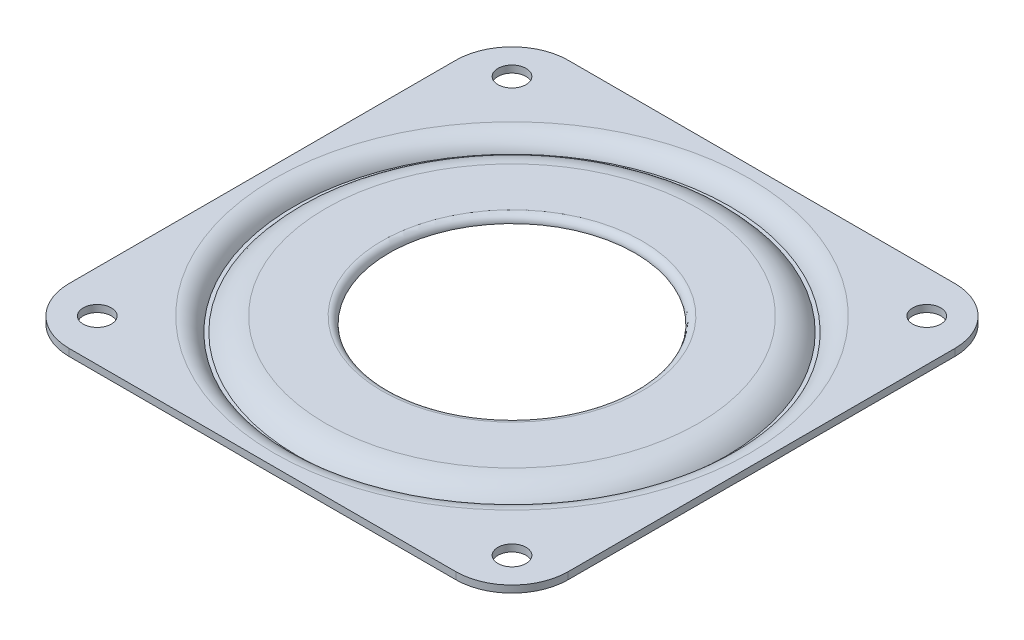
ISO-10303-21;
HEADER;
FILE_DESCRIPTION(('STEP AP214'),'2;1');
FILE_NAME('part.step','',(''),(''),'','','');
FILE_SCHEMA(('AUTOMOTIVE_DESIGN { 1 0 10303 214 1 1 1 1 }'));
ENDSEC;
DATA;
#1=APPLICATION_CONTEXT('core data for automotive mechanical design processes');
#2=APPLICATION_PROTOCOL_DEFINITION('international standard','automotive_design',2000,#1);
#3=PRODUCT_CONTEXT('',#1,'mechanical');
#4=PRODUCT('Part','Part','',(#3));
#5=PRODUCT_RELATED_PRODUCT_CATEGORY('part','',(#4));
#6=PRODUCT_DEFINITION_FORMATION('','',#4);
#7=PRODUCT_DEFINITION_CONTEXT('part definition',#1,'design');
#8=PRODUCT_DEFINITION('design','',#6,#7);
#9=PRODUCT_DEFINITION_SHAPE('','',#8);
#10=(LENGTH_UNIT() NAMED_UNIT(*) SI_UNIT(.MILLI.,.METRE.));
#11=(NAMED_UNIT(*) PLANE_ANGLE_UNIT() SI_UNIT($,.RADIAN.));
#12=(NAMED_UNIT(*) SI_UNIT($,.STERADIAN.) SOLID_ANGLE_UNIT());
#13=UNCERTAINTY_MEASURE_WITH_UNIT(LENGTH_MEASURE(1.E-05),#10,'distance_accuracy_value','');
#14=(GEOMETRIC_REPRESENTATION_CONTEXT(3) GLOBAL_UNCERTAINTY_ASSIGNED_CONTEXT((#13)) GLOBAL_UNIT_ASSIGNED_CONTEXT((#10,
#11,#12)) REPRESENTATION_CONTEXT('',''));
#15=CARTESIAN_POINT('',(0.,0.,0.));
#16=DIRECTION('',(0.,0.,1.));
#17=DIRECTION('',(1.,0.,0.));
#18=AXIS2_PLACEMENT_3D('',#15,#16,#17);
#19=CARTESIAN_POINT('',(0.,2.,0.));
#20=DIRECTION('',(0.,-1.,0.));
#21=DIRECTION('',(0.,0.,-1.));
#22=AXIS2_PLACEMENT_3D('',#19,#20,#21);
#23=PLANE('',#22);
#24=CARTESIAN_POINT('',(65.0000000000002,2.,-6.00000000000001));
#25=DIRECTION('',(0.,-1.,0.));
#26=DIRECTION('',(0.,0.,-1.));
#27=AXIS2_PLACEMENT_3D('',#24,#25,#26);
#28=CIRCLE('',#27,2.);
#29=CARTESIAN_POINT('',(65.0000000000002,2.,-8.00000000000001));
#30=VERTEX_POINT('',#29);
#31=EDGE_CURVE('E163',#30,#30,#28,.F.);
#32=ORIENTED_EDGE('',*,*,#31,.T.);
#33=EDGE_LOOP('',(#32));
#34=FACE_BOUND('',#33,.T.);
#35=DIRECTION('',(-1.,0.,0.));
#36=VECTOR('',#35,1.);
#37=CARTESIAN_POINT('',(0.,2.,0.));
#38=LINE('',#37,#36);
#39=CARTESIAN_POINT('',(63.,2.,0.));
#40=VERTEX_POINT('',#39);
#41=CARTESIAN_POINT('',(41.2590454924366,2.,0.));
#42=VERTEX_POINT('',#41);
#43=EDGE_CURVE('E281',#40,#42,#38,.T.);
#44=ORIENTED_EDGE('',*,*,#43,.T.);
#45=CARTESIAN_POINT('',(35.5,2.,-35.5));
#46=DIRECTION('',(0.,-1.,0.));
#47=DIRECTION('',(0.,0.,-1.));
#48=AXIS2_PLACEMENT_3D('',#45,#46,#47);
#49=CIRCLE('',#48,35.9641016151378);
#50=CARTESIAN_POINT('',(71.,2.,-29.7409545075634));
#51=VERTEX_POINT('',#50);
#52=EDGE_CURVE('E225',#42,#51,#49,.F.);
#53=ORIENTED_EDGE('',*,*,#52,.T.);
#54=DIRECTION('',(0.,0.,1.));
#55=VECTOR('',#54,1.);
#56=CARTESIAN_POINT('',(71.,2.,0.));
#57=LINE('',#56,#55);
#58=CARTESIAN_POINT('',(71.,2.,-8.));
#59=VERTEX_POINT('',#58);
#60=EDGE_CURVE('E279',#51,#59,#57,.T.);
#61=ORIENTED_EDGE('',*,*,#60,.T.);
#62=CARTESIAN_POINT('',(63.,2.,-8.));
#63=DIRECTION('',(0.,-1.,0.));
#64=DIRECTION('',(0.,0.,-1.));
#65=AXIS2_PLACEMENT_3D('',#62,#63,#64);
#66=CIRCLE('',#65,8.);
#67=EDGE_CURVE('E288',#59,#40,#66,.T.);
#68=ORIENTED_EDGE('',*,*,#67,.T.);
#69=EDGE_LOOP('',(#44,#53,#61,#68));
#70=FACE_BOUND('',#69,.T.);
#71=ADVANCED_FACE('F61',(#34,#70),#23,.T.);
#72=CARTESIAN_POINT('',(65.,2.,-65.));
#73=DIRECTION('',(0.,-1.,0.));
#74=DIRECTION('',(0.,0.,-1.));
#75=AXIS2_PLACEMENT_3D('',#72,#73,#74);
#76=CIRCLE('',#75,2.);
#77=CARTESIAN_POINT('',(65.,2.,-67.));
#78=VERTEX_POINT('',#77);
#79=EDGE_CURVE('E293',#78,#78,#76,.F.);
#80=ORIENTED_EDGE('',*,*,#79,.T.);
#81=EDGE_LOOP('',(#80));
#82=FACE_BOUND('',#81,.T.);
#83=CARTESIAN_POINT('',(71.,2.,-63.));
#84=VERTEX_POINT('',#83);
#85=CARTESIAN_POINT('',(71.,2.,-41.2590454924366));
#86=VERTEX_POINT('',#85);
#87=EDGE_CURVE('E286',#84,#86,#57,.T.);
#88=ORIENTED_EDGE('',*,*,#87,.T.);
#89=CARTESIAN_POINT('',(35.5,2.,-35.5));
#90=DIRECTION('',(0.,-1.,0.));
#91=DIRECTION('',(0.,0.,-1.));
#92=AXIS2_PLACEMENT_3D('',#89,#90,#91);
#93=CIRCLE('',#92,35.9641016151378);
#94=CARTESIAN_POINT('',(41.2590454924366,2.,-71.));
#95=VERTEX_POINT('',#94);
#96=EDGE_CURVE('E223',#86,#95,#93,.F.);
#97=ORIENTED_EDGE('',*,*,#96,.T.);
#98=DIRECTION('',(1.,0.,0.));
#99=VECTOR('',#98,1.);
#100=CARTESIAN_POINT('',(0.,2.,-71.));
#101=LINE('',#100,#99);
#102=CARTESIAN_POINT('',(63.,2.,-71.));
#103=VERTEX_POINT('',#102);
#104=EDGE_CURVE('E266',#95,#103,#101,.T.);
#105=ORIENTED_EDGE('',*,*,#104,.T.);
#106=CARTESIAN_POINT('',(63.,2.,-63.));
#107=DIRECTION('',(0.,-1.,0.));
#108=DIRECTION('',(0.,0.,-1.));
#109=AXIS2_PLACEMENT_3D('',#106,#107,#108);
#110=CIRCLE('',#109,8.);
#111=EDGE_CURVE('E273',#103,#84,#110,.T.);
#112=ORIENTED_EDGE('',*,*,#111,.T.);
#113=EDGE_LOOP('',(#88,#97,#105,#112));
#114=FACE_BOUND('',#113,.T.);
#115=ADVANCED_FACE('F354',(#82,#114),#23,.T.);
#116=CARTESIAN_POINT('',(5.9999999999998,2.,-65.));
#117=DIRECTION('',(0.,-1.,0.));
#118=DIRECTION('',(0.,0.,-1.));
#119=AXIS2_PLACEMENT_3D('',#116,#117,#118);
#120=CIRCLE('',#119,2.);
#121=CARTESIAN_POINT('',(5.9999999999998,2.,-67.));
#122=VERTEX_POINT('',#121);
#123=EDGE_CURVE('E386',#122,#122,#120,.F.);
#124=ORIENTED_EDGE('',*,*,#123,.T.);
#125=EDGE_LOOP('',(#124));
#126=FACE_BOUND('',#125,.T.);
#127=CARTESIAN_POINT('',(8.,2.,-71.));
#128=VERTEX_POINT('',#127);
#129=CARTESIAN_POINT('',(29.7409545075634,2.,-71.));
#130=VERTEX_POINT('',#129);
#131=EDGE_CURVE('E264',#128,#130,#101,.T.);
#132=ORIENTED_EDGE('',*,*,#131,.T.);
#133=CARTESIAN_POINT('',(35.5,2.,-35.5));
#134=DIRECTION('',(0.,-1.,0.));
#135=DIRECTION('',(0.,0.,-1.));
#136=AXIS2_PLACEMENT_3D('',#133,#134,#135);
#137=CIRCLE('',#136,35.9641016151378);
#138=CARTESIAN_POINT('',(0.,2.,-41.2590454924366));
#139=VERTEX_POINT('',#138);
#140=EDGE_CURVE('E221',#130,#139,#137,.F.);
#141=ORIENTED_EDGE('',*,*,#140,.T.);
#142=DIRECTION('',(0.,0.,-1.));
#143=VECTOR('',#142,1.);
#144=CARTESIAN_POINT('',(0.,2.,0.));
#145=LINE('',#144,#143);
#146=CARTESIAN_POINT('',(0.,2.,-63.));
#147=VERTEX_POINT('',#146);
#148=EDGE_CURVE('E162',#139,#147,#145,.T.);
#149=ORIENTED_EDGE('',*,*,#148,.T.);
#150=CARTESIAN_POINT('',(8.,2.,-63.));
#151=DIRECTION('',(0.,-1.,0.));
#152=DIRECTION('',(0.,0.,-1.));
#153=AXIS2_PLACEMENT_3D('',#150,#151,#152);
#154=CIRCLE('',#153,8.);
#155=EDGE_CURVE('E172',#147,#128,#154,.T.);
#156=ORIENTED_EDGE('',*,*,#155,.T.);
#157=EDGE_LOOP('',(#132,#141,#149,#156));
#158=FACE_BOUND('',#157,.T.);
#159=ADVANCED_FACE('F271',(#126,#158),#23,.T.);
#160=CARTESIAN_POINT('',(0.,0.,0.));
#161=DIRECTION('',(0.,-1.,0.));
#162=DIRECTION('',(0.,0.,-1.));
#163=AXIS2_PLACEMENT_3D('',#160,#161,#162);
#164=PLANE('',#163);
#165=CARTESIAN_POINT('',(35.5,0.,-35.5));
#166=DIRECTION('',(0.,-1.,0.));
#167=DIRECTION('',(0.,0.,-1.));
#168=AXIS2_PLACEMENT_3D('',#165,#166,#167);
#169=CIRCLE('',#168,29.);
#170=CARTESIAN_POINT('',(35.5,0.,-64.5));
#171=VERTEX_POINT('',#170);
#172=EDGE_CURVE('E394',#171,#171,#169,.T.);
#173=ORIENTED_EDGE('',*,*,#172,.F.);
#174=EDGE_LOOP('',(#173));
#175=FACE_BOUND('',#174,.T.);
#176=CARTESIAN_POINT('',(35.5,0.,-35.5));
#177=DIRECTION('',(0.,-1.,0.));
#178=DIRECTION('',(0.,0.,-1.));
#179=AXIS2_PLACEMENT_3D('',#176,#177,#178);
#180=CIRCLE('',#179,32.5);
#181=CARTESIAN_POINT('',(35.5,0.,-68.));
#182=VERTEX_POINT('',#181);
#183=EDGE_CURVE('E297',#182,#182,#180,.T.);
#184=ORIENTED_EDGE('',*,*,#183,.T.);
#185=EDGE_LOOP('',(#184));
#186=FACE_BOUND('',#185,.T.);
#187=ADVANCED_FACE('F253',(#175,#186),#164,.T.);
#188=CARTESIAN_POINT('',(0.,3.,0.));
#189=DIRECTION('',(1.,0.,0.));
#190=DIRECTION('',(0.,0.,-1.));
#191=AXIS2_PLACEMENT_3D('',#188,#189,#190);
#192=PLANE('',#191);
#193=CARTESIAN_POINT('',(0.,2.,-8.));
#194=VERTEX_POINT('',#193);
#195=CARTESIAN_POINT('',(0.,2.,-29.7409545075634));
#196=VERTEX_POINT('',#195);
#197=EDGE_CURVE('E156',#194,#196,#145,.T.);
#198=ORIENTED_EDGE('',*,*,#197,.F.);
#199=DIRECTION('',(0.,-1.,0.));
#200=VECTOR('',#199,1.);
#201=CARTESIAN_POINT('',(0.,3.,-8.));
#202=LINE('',#201,#200);
#203=CARTESIAN_POINT('',(0.,3.,-8.));
#204=VERTEX_POINT('',#203);
#205=EDGE_CURVE('E168',#194,#204,#202,.F.);
#206=ORIENTED_EDGE('',*,*,#205,.T.);
#207=DIRECTION('',(0.,0.,1.));
#208=VECTOR('',#207,1.);
#209=CARTESIAN_POINT('',(0.,3.,0.));
#210=LINE('',#209,#208);
#211=CARTESIAN_POINT('',(0.,3.,-63.));
#212=VERTEX_POINT('',#211);
#213=EDGE_CURVE('E319',#212,#204,#210,.T.);
#214=ORIENTED_EDGE('',*,*,#213,.F.);
#215=DIRECTION('',(0.,-1.,0.));
#216=VECTOR('',#215,1.);
#217=CARTESIAN_POINT('',(0.,3.,-63.));
#218=LINE('',#217,#216);
#219=EDGE_CURVE('E177',#212,#147,#218,.T.);
#220=ORIENTED_EDGE('',*,*,#219,.T.);
#221=ORIENTED_EDGE('',*,*,#148,.F.);
#222=CARTESIAN_POINT('',(0.,2.,-41.2590454924366));
#223=CARTESIAN_POINT('',(0.,1.99999809853683,-41.0923758040359));
#224=CARTESIAN_POINT('',(0.,1.99973283204652,-40.9257064601679));
#225=CARTESIAN_POINT('',(0.,1.9987973192097,-40.5923699857615));
#226=CARTESIAN_POINT('',(0.,1.99812707559933,-40.4257028552159));
#227=CARTESIAN_POINT('',(0.,1.9965033570419,-40.0923704157217));
#228=CARTESIAN_POINT('',(0.,1.99554988266604,-39.9257051067702));
#229=CARTESIAN_POINT('',(0.,1.99346691741252,-39.5923749367902));
#230=CARTESIAN_POINT('',(0.,1.99233742582151,-39.4257100757661));
#231=CARTESIAN_POINT('',(0.,1.98883482504903,-38.9257041831819));
#232=CARTESIAN_POINT('',(0.,1.98634766385005,-38.5923639847862));
#233=CARTESIAN_POINT('',(0.,1.98171762333512,-37.9256810574722));
#234=CARTESIAN_POINT('',(0.,1.97957474399237,-37.5923383285541));
#235=CARTESIAN_POINT('',(0.,1.97608682037531,-36.9256520559874));
#236=CARTESIAN_POINT('',(0.,1.97474176734527,-36.5923085123879));
#237=CARTESIAN_POINT('',(0.,1.97310663949925,-35.925618858548));
#238=CARTESIAN_POINT('',(0.,1.97281656409642,-35.5922727483091));
#239=CARTESIAN_POINT('',(0.,1.97334446618624,-34.9255818275176));
#240=CARTESIAN_POINT('',(0.,1.97416244245752,-34.592237016964));
#241=CARTESIAN_POINT('',(0.,1.97675461460996,-33.9255510842902));
#242=CARTESIAN_POINT('',(0.,1.97852881128743,-33.5922099621734));
#243=CARTESIAN_POINT('',(0.,1.98268031870732,-32.9255285455048));
#244=CARTESIAN_POINT('',(0.,1.98505763524318,-32.5921882509916));
#245=CARTESIAN_POINT('',(0.,1.9898679163736,-31.9255082525674));
#246=CARTESIAN_POINT('',(0.,1.99230088094763,-31.5921685486563));
#247=CARTESIAN_POINT('',(0.,1.99598675760966,-31.0058505545712));
#248=CARTESIAN_POINT('',(0.,1.99738275399137,-30.7528732947871));
#249=CARTESIAN_POINT('',(0.,1.99938447833095,-30.2469160318604));
#250=CARTESIAN_POINT('',(0.,1.99999020683266,-29.9939360287199));
#251=CARTESIAN_POINT('',(0.,2.,-29.7409545075634));
#252=B_SPLINE_CURVE_WITH_KNOTS('',3,(#222,#223,#224,#225,#226,#227,#228,#229,#230,#231,#232,
#233,#234,#235,#236,#237,#238,#239,#240,#241,#242,#243,#244,#245,#246,#247,#248,#249,#250,#251),
.UNSPECIFIED.,.F.,.F.,(4,2,2,2,2,2,2,2,2,2,2,2,2,2,4),(0.,0.500008372601376,1.00001336705712,
1.50001735315875,2.00002336568205,3.00007181940902,4.0001201953306,5.00015759605728,
6.0001944405086,7.00023018265512,8.00026675759234,9.00031293900684,10.0003587513124,
10.7593010635904,11.5182428535808),.UNSPECIFIED.);
#253=EDGE_CURVE('E74',#139,#196,#252,.T.);
#254=ORIENTED_EDGE('',*,*,#253,.T.);
#255=EDGE_LOOP('',(#198,#206,#214,#220,#221,#254));
#256=FACE_BOUND('',#255,.T.);
#257=ADVANCED_FACE('F166',(#256),#192,.F.);
#258=CARTESIAN_POINT('',(0.,3.,0.));
#259=DIRECTION('',(0.,0.,-1.));
#260=DIRECTION('',(-1.,0.,0.));
#261=AXIS2_PLACEMENT_3D('',#258,#259,#260);
#262=PLANE('',#261);
#263=ORIENTED_EDGE('',*,*,#43,.F.);
#264=DIRECTION('',(0.,-1.,0.));
#265=VECTOR('',#264,1.);
#266=CARTESIAN_POINT('',(63.,3.,0.));
#267=LINE('',#266,#265);
#268=CARTESIAN_POINT('',(63.,3.,0.));
#269=VERTEX_POINT('',#268);
#270=EDGE_CURVE('E199',#40,#269,#267,.F.);
#271=ORIENTED_EDGE('',*,*,#270,.T.);
#272=DIRECTION('',(1.,0.,0.));
#273=VECTOR('',#272,1.);
#274=CARTESIAN_POINT('',(0.,3.,0.));
#275=LINE('',#274,#273);
#276=CARTESIAN_POINT('',(8.,3.,0.));
#277=VERTEX_POINT('',#276);
#278=EDGE_CURVE('E321',#277,#269,#275,.T.);
#279=ORIENTED_EDGE('',*,*,#278,.F.);
#280=DIRECTION('',(0.,-1.,0.));
#281=VECTOR('',#280,1.);
#282=CARTESIAN_POINT('',(8.,3.,0.));
#283=LINE('',#282,#281);
#284=CARTESIAN_POINT('',(8.,2.,0.));
#285=VERTEX_POINT('',#284);
#286=EDGE_CURVE('E201',#277,#285,#283,.T.);
#287=ORIENTED_EDGE('',*,*,#286,.T.);
#288=CARTESIAN_POINT('',(29.7409545075634,2.,0.));
#289=VERTEX_POINT('',#288);
#290=EDGE_CURVE('E157',#289,#285,#38,.T.);
#291=ORIENTED_EDGE('',*,*,#290,.F.);
#292=CARTESIAN_POINT('',(29.7409545075634,2.,0.));
#293=CARTESIAN_POINT('',(29.9076241959641,1.99999809853683,0.));
#294=CARTESIAN_POINT('',(30.0742935398321,1.99973283204652,0.));
#295=CARTESIAN_POINT('',(30.4076300142385,1.9987973192097,0.));
#296=CARTESIAN_POINT('',(30.5742971447841,1.99812707559933,0.));
#297=CARTESIAN_POINT('',(30.9076295842783,1.9965033570419,0.));
#298=CARTESIAN_POINT('',(31.0742948932298,1.99554988266604,0.));
#299=CARTESIAN_POINT('',(31.4076250632098,1.99346691741252,0.));
#300=CARTESIAN_POINT('',(31.5742899242339,1.99233742582151,0.));
#301=CARTESIAN_POINT('',(32.0742958168181,1.98883482504903,0.));
#302=CARTESIAN_POINT('',(32.4076360152138,1.98634766385005,0.));
#303=CARTESIAN_POINT('',(33.0743189425278,1.98171762333512,0.));
#304=CARTESIAN_POINT('',(33.4076616714459,1.97957474399237,0.));
#305=CARTESIAN_POINT('',(34.0743479440126,1.9760868203753,0.));
#306=CARTESIAN_POINT('',(34.4076914876121,1.97474176734527,0.));
#307=CARTESIAN_POINT('',(35.074381141452,1.97310663949925,0.));
#308=CARTESIAN_POINT('',(35.4077272516909,1.97281656409642,0.));
#309=CARTESIAN_POINT('',(36.0744181724824,1.97334446618624,0.));
#310=CARTESIAN_POINT('',(36.407762983036,1.97416244245752,0.));
#311=CARTESIAN_POINT('',(37.0744489157098,1.97675461460996,0.));
#312=CARTESIAN_POINT('',(37.4077900378266,1.97852881128743,0.));
#313=CARTESIAN_POINT('',(38.0744714544952,1.98268031870732,0.));
#314=CARTESIAN_POINT('',(38.4078117490084,1.98505763524318,0.));
#315=CARTESIAN_POINT('',(39.0744917474325,1.9898679163736,0.));
#316=CARTESIAN_POINT('',(39.4078314513437,1.99230088094763,0.));
#317=CARTESIAN_POINT('',(39.9941494454288,1.99598675760966,0.));
#318=CARTESIAN_POINT('',(40.2471267052129,1.99738275399137,0.));
#319=CARTESIAN_POINT('',(40.7530839681396,1.99938447833095,0.));
#320=CARTESIAN_POINT('',(41.0060639712801,1.99999020683266,0.));
#321=CARTESIAN_POINT('',(41.2590454924366,2.,0.));
#322=B_SPLINE_CURVE_WITH_KNOTS('',3,(#292,#293,#294,#295,#296,#297,#298,#299,#300,#301,#302,
#303,#304,#305,#306,#307,#308,#309,#310,#311,#312,#313,#314,#315,#316,#317,#318,#319,#320,#321),
.UNSPECIFIED.,.F.,.F.,(4,2,2,2,2,2,2,2,2,2,2,2,2,2,4),(0.,0.500008372601376,1.00001336705712,
1.50001735315874,2.00002336568204,3.00007181940902,4.0001201953306,5.00015759605728,
6.0001944405086,7.00023018265512,8.00026675759233,9.00031293900683,10.0003587513124,
10.7593010635904,11.5182428535808),.UNSPECIFIED.);
#323=EDGE_CURVE('E12',#289,#42,#322,.T.);
#324=ORIENTED_EDGE('',*,*,#323,.T.);
#325=EDGE_LOOP('',(#263,#271,#279,#287,#291,#324));
#326=FACE_BOUND('',#325,.T.);
#327=ADVANCED_FACE('F243',(#326),#262,.F.);
#328=CARTESIAN_POINT('',(71.,3.,0.));
#329=DIRECTION('',(-1.,0.,0.));
#330=DIRECTION('',(0.,0.,1.));
#331=AXIS2_PLACEMENT_3D('',#328,#329,#330);
#332=PLANE('',#331);
#333=ORIENTED_EDGE('',*,*,#87,.F.);
#334=DIRECTION('',(0.,-1.,0.));
#335=VECTOR('',#334,1.);
#336=CARTESIAN_POINT('',(71.,3.,-63.));
#337=LINE('',#336,#335);
#338=CARTESIAN_POINT('',(71.,3.,-63.));
#339=VERTEX_POINT('',#338);
#340=EDGE_CURVE('E206',#84,#339,#337,.F.);
#341=ORIENTED_EDGE('',*,*,#340,.T.);
#342=DIRECTION('',(0.,0.,-1.));
#343=VECTOR('',#342,1.);
#344=CARTESIAN_POINT('',(71.,3.,0.));
#345=LINE('',#344,#343);
#346=CARTESIAN_POINT('',(71.,3.,-8.));
#347=VERTEX_POINT('',#346);
#348=EDGE_CURVE('E184',#347,#339,#345,.T.);
#349=ORIENTED_EDGE('',*,*,#348,.F.);
#350=DIRECTION('',(0.,-1.,0.));
#351=VECTOR('',#350,1.);
#352=CARTESIAN_POINT('',(71.,3.,-8.));
#353=LINE('',#352,#351);
#354=EDGE_CURVE('E203',#347,#59,#353,.T.);
#355=ORIENTED_EDGE('',*,*,#354,.T.);
#356=ORIENTED_EDGE('',*,*,#60,.F.);
#357=CARTESIAN_POINT('',(71.,2.,-29.7409545075634));
#358=CARTESIAN_POINT('',(71.,1.99999809853683,-29.9076241959641));
#359=CARTESIAN_POINT('',(71.,1.99973283204652,-30.0742935398321));
#360=CARTESIAN_POINT('',(71.,1.9987973192097,-30.4076300142385));
#361=CARTESIAN_POINT('',(71.,1.99812707559933,-30.5742971447841));
#362=CARTESIAN_POINT('',(71.,1.9965033570419,-30.9076295842783));
#363=CARTESIAN_POINT('',(71.,1.99554988266604,-31.0742948932298));
#364=CARTESIAN_POINT('',(71.,1.99346691741252,-31.4076250632098));
#365=CARTESIAN_POINT('',(71.,1.99233742582151,-31.5742899242339));
#366=CARTESIAN_POINT('',(71.,1.98883482504903,-32.0742958168181));
#367=CARTESIAN_POINT('',(71.,1.98634766385005,-32.4076360152138));
#368=CARTESIAN_POINT('',(71.,1.98171762333512,-33.0743189425278));
#369=CARTESIAN_POINT('',(71.,1.97957474399237,-33.4076616714459));
#370=CARTESIAN_POINT('',(71.,1.9760868203753,-34.0743479440126));
#371=CARTESIAN_POINT('',(71.,1.97474176734527,-34.4076914876121));
#372=CARTESIAN_POINT('',(71.,1.97310663949925,-35.074381141452));
#373=CARTESIAN_POINT('',(71.,1.97281656409642,-35.4077272516909));
#374=CARTESIAN_POINT('',(71.,1.97334446618624,-36.0744181724824));
#375=CARTESIAN_POINT('',(71.,1.97416244245752,-36.407762983036));
#376=CARTESIAN_POINT('',(71.,1.97675461460996,-37.0744489157098));
#377=CARTESIAN_POINT('',(71.,1.97852881128743,-37.4077900378266));
#378=CARTESIAN_POINT('',(71.,1.98268031870732,-38.0744714544952));
#379=CARTESIAN_POINT('',(71.,1.98505763524318,-38.4078117490084));
#380=CARTESIAN_POINT('',(71.,1.9898679163736,-39.0744917474325));
#381=CARTESIAN_POINT('',(71.,1.99230088094763,-39.4078314513437));
#382=CARTESIAN_POINT('',(71.,1.99598675760966,-39.9941494454288));
#383=CARTESIAN_POINT('',(71.,1.99738275399137,-40.2471267052129));
#384=CARTESIAN_POINT('',(71.,1.99938447833095,-40.7530839681396));
#385=CARTESIAN_POINT('',(71.,1.99999020683266,-41.0060639712801));
#386=CARTESIAN_POINT('',(71.,2.,-41.2590454924366));
#387=B_SPLINE_CURVE_WITH_KNOTS('',3,(#357,#358,#359,#360,#361,#362,#363,#364,#365,#366,#367,
#368,#369,#370,#371,#372,#373,#374,#375,#376,#377,#378,#379,#380,#381,#382,#383,#384,#385,#386),
.UNSPECIFIED.,.F.,.F.,(4,2,2,2,2,2,2,2,2,2,2,2,2,2,4),(0.,0.500008372601376,1.00001336705712,
1.50001735315874,2.00002336568204,3.00007181940902,4.0001201953306,5.00015759605728,
6.0001944405086,7.00023018265512,8.00026675759233,9.00031293900683,10.0003587513124,
10.7593010635904,11.5182428535808),.UNSPECIFIED.);
#388=EDGE_CURVE('E228',#51,#86,#387,.T.);
#389=ORIENTED_EDGE('',*,*,#388,.T.);
#390=EDGE_LOOP('',(#333,#341,#349,#355,#356,#389));
#391=FACE_BOUND('',#390,.T.);
#392=ADVANCED_FACE('F239',(#391),#332,.F.);
#393=CARTESIAN_POINT('',(0.,3.,-71.));
#394=DIRECTION('',(0.,0.,1.));
#395=DIRECTION('',(1.,0.,0.));
#396=AXIS2_PLACEMENT_3D('',#393,#394,#395);
#397=PLANE('',#396);
#398=ORIENTED_EDGE('',*,*,#131,.F.);
#399=DIRECTION('',(0.,-1.,0.));
#400=VECTOR('',#399,1.);
#401=CARTESIAN_POINT('',(8.,3.,-71.));
#402=LINE('',#401,#400);
#403=CARTESIAN_POINT('',(8.,3.,-71.));
#404=VERTEX_POINT('',#403);
#405=EDGE_CURVE('E190',#128,#404,#402,.F.);
#406=ORIENTED_EDGE('',*,*,#405,.T.);
#407=DIRECTION('',(-1.,0.,0.));
#408=VECTOR('',#407,1.);
#409=CARTESIAN_POINT('',(0.,3.,-71.));
#410=LINE('',#409,#408);
#411=CARTESIAN_POINT('',(63.,3.,-71.));
#412=VERTEX_POINT('',#411);
#413=EDGE_CURVE('E178',#412,#404,#410,.T.);
#414=ORIENTED_EDGE('',*,*,#413,.F.);
#415=DIRECTION('',(0.,-1.,0.));
#416=VECTOR('',#415,1.);
#417=CARTESIAN_POINT('',(63.,3.,-71.));
#418=LINE('',#417,#416);
#419=EDGE_CURVE('E181',#412,#103,#418,.T.);
#420=ORIENTED_EDGE('',*,*,#419,.T.);
#421=ORIENTED_EDGE('',*,*,#104,.F.);
#422=CARTESIAN_POINT('',(41.2590454924366,2.,-71.));
#423=CARTESIAN_POINT('',(41.0923758040359,1.99999809853683,-71.));
#424=CARTESIAN_POINT('',(40.9257064601679,1.99973283204652,-71.));
#425=CARTESIAN_POINT('',(40.5923699857615,1.9987973192097,-71.));
#426=CARTESIAN_POINT('',(40.4257028552159,1.99812707559933,-71.));
#427=CARTESIAN_POINT('',(40.0923704157217,1.9965033570419,-71.));
#428=CARTESIAN_POINT('',(39.9257051067702,1.99554988266604,-71.));
#429=CARTESIAN_POINT('',(39.5923749367902,1.99346691741252,-71.));
#430=CARTESIAN_POINT('',(39.4257100757661,1.99233742582151,-71.));
#431=CARTESIAN_POINT('',(38.9257041831819,1.98883482504903,-71.));
#432=CARTESIAN_POINT('',(38.5923639847862,1.98634766385005,-71.));
#433=CARTESIAN_POINT('',(37.9256810574722,1.98171762333512,-71.));
#434=CARTESIAN_POINT('',(37.5923383285541,1.97957474399237,-71.));
#435=CARTESIAN_POINT('',(36.9256520559874,1.97608682037531,-71.));
#436=CARTESIAN_POINT('',(36.5923085123879,1.97474176734527,-71.));
#437=CARTESIAN_POINT('',(35.925618858548,1.97310663949925,-71.));
#438=CARTESIAN_POINT('',(35.5922727483091,1.97281656409642,-71.));
#439=CARTESIAN_POINT('',(34.9255818275176,1.97334446618624,-71.));
#440=CARTESIAN_POINT('',(34.592237016964,1.97416244245752,-71.));
#441=CARTESIAN_POINT('',(33.9255510842902,1.97675461460996,-71.));
#442=CARTESIAN_POINT('',(33.5922099621734,1.97852881128743,-71.));
#443=CARTESIAN_POINT('',(32.9255285455048,1.98268031870732,-71.));
#444=CARTESIAN_POINT('',(32.5921882509916,1.98505763524318,-71.));
#445=CARTESIAN_POINT('',(31.9255082525674,1.9898679163736,-71.));
#446=CARTESIAN_POINT('',(31.5921685486563,1.99230088094763,-71.));
#447=CARTESIAN_POINT('',(31.0058505545712,1.99598675760966,-71.));
#448=CARTESIAN_POINT('',(30.7528732947871,1.99738275399137,-71.));
#449=CARTESIAN_POINT('',(30.2469160318604,1.99938447833095,-71.));
#450=CARTESIAN_POINT('',(29.9939360287199,1.99999020683266,-71.));
#451=CARTESIAN_POINT('',(29.7409545075634,2.,-71.));
#452=B_SPLINE_CURVE_WITH_KNOTS('',3,(#422,#423,#424,#425,#426,#427,#428,#429,#430,#431,#432,
#433,#434,#435,#436,#437,#438,#439,#440,#441,#442,#443,#444,#445,#446,#447,#448,#449,#450,#451),
.UNSPECIFIED.,.F.,.F.,(4,2,2,2,2,2,2,2,2,2,2,2,2,2,4),(0.,0.500008372601376,1.00001336705712,
1.50001735315875,2.00002336568205,3.00007181940902,4.0001201953306,5.00015759605728,
6.0001944405086,7.00023018265512,8.00026675759234,9.00031293900684,10.0003587513124,
10.7593010635904,11.5182428535808),.UNSPECIFIED.);
#453=EDGE_CURVE('E234',#95,#130,#452,.T.);
#454=ORIENTED_EDGE('',*,*,#453,.T.);
#455=EDGE_LOOP('',(#398,#406,#414,#420,#421,#454));
#456=FACE_BOUND('',#455,.T.);
#457=ADVANCED_FACE('F242',(#456),#397,.F.);
#458=CARTESIAN_POINT('',(6.,3.,-6.));
#459=DIRECTION('',(0.,-1.,0.));
#460=DIRECTION('',(0.,0.,-1.));
#461=AXIS2_PLACEMENT_3D('',#458,#459,#460);
#462=CYLINDRICAL_SURFACE('',#461,2.);
#463=CARTESIAN_POINT('',(6.,3.,-6.));
#464=DIRECTION('',(0.,1.,0.));
#465=DIRECTION('',(0.,0.,1.));
#466=AXIS2_PLACEMENT_3D('',#463,#464,#465);
#467=CIRCLE('',#466,2.);
#468=CARTESIAN_POINT('',(6.,3.,-4.));
#469=VERTEX_POINT('',#468);
#470=EDGE_CURVE('E316',#469,#469,#467,.T.);
#471=ORIENTED_EDGE('',*,*,#470,.T.);
#472=EDGE_LOOP('',(#471));
#473=FACE_BOUND('',#472,.T.);
#474=CARTESIAN_POINT('',(6.,2.,-6.));
#475=DIRECTION('',(0.,-1.,0.));
#476=DIRECTION('',(0.,0.,-1.));
#477=AXIS2_PLACEMENT_3D('',#474,#475,#476);
#478=CIRCLE('',#477,2.);
#479=CARTESIAN_POINT('',(6.,2.,-8.));
#480=VERTEX_POINT('',#479);
#481=EDGE_CURVE('E300',#480,#480,#478,.F.);
#482=ORIENTED_EDGE('',*,*,#481,.F.);
#483=EDGE_LOOP('',(#482));
#484=FACE_BOUND('',#483,.T.);
#485=ADVANCED_FACE('F446',(#473,#484),#462,.F.);
#486=CARTESIAN_POINT('',(65.0000000000002,3.,-6.00000000000001));
#487=DIRECTION('',(0.,-1.,0.));
#488=DIRECTION('',(0.,0.,-1.));
#489=AXIS2_PLACEMENT_3D('',#486,#487,#488);
#490=CYLINDRICAL_SURFACE('',#489,2.);
#491=CARTESIAN_POINT('',(65.0000000000002,3.,-6.00000000000001));
#492=DIRECTION('',(0.,1.,0.));
#493=DIRECTION('',(0.,0.,1.));
#494=AXIS2_PLACEMENT_3D('',#491,#492,#493);
#495=CIRCLE('',#494,2.);
#496=CARTESIAN_POINT('',(65.0000000000002,3.,-4.00000000000002));
#497=VERTEX_POINT('',#496);
#498=EDGE_CURVE('E313',#497,#497,#495,.T.);
#499=ORIENTED_EDGE('',*,*,#498,.T.);
#500=EDGE_LOOP('',(#499));
#501=FACE_BOUND('',#500,.T.);
#502=ORIENTED_EDGE('',*,*,#31,.F.);
#503=EDGE_LOOP('',(#502));
#504=FACE_BOUND('',#503,.T.);
#505=ADVANCED_FACE('F442',(#501,#504),#490,.F.);
#506=CARTESIAN_POINT('',(65.,3.,-65.));
#507=DIRECTION('',(0.,-1.,0.));
#508=DIRECTION('',(0.,0.,-1.));
#509=AXIS2_PLACEMENT_3D('',#506,#507,#508);
#510=CYLINDRICAL_SURFACE('',#509,2.);
#511=CARTESIAN_POINT('',(65.,3.,-65.));
#512=DIRECTION('',(0.,1.,0.));
#513=DIRECTION('',(0.,0.,1.));
#514=AXIS2_PLACEMENT_3D('',#511,#512,#513);
#515=CIRCLE('',#514,2.);
#516=CARTESIAN_POINT('',(65.,3.,-63.));
#517=VERTEX_POINT('',#516);
#518=EDGE_CURVE('E310',#517,#517,#515,.T.);
#519=ORIENTED_EDGE('',*,*,#518,.T.);
#520=EDGE_LOOP('',(#519));
#521=FACE_BOUND('',#520,.T.);
#522=ORIENTED_EDGE('',*,*,#79,.F.);
#523=EDGE_LOOP('',(#522));
#524=FACE_BOUND('',#523,.T.);
#525=ADVANCED_FACE('F438',(#521,#524),#510,.F.);
#526=CARTESIAN_POINT('',(5.9999999999998,3.,-65.));
#527=DIRECTION('',(0.,-1.,0.));
#528=DIRECTION('',(0.,0.,-1.));
#529=AXIS2_PLACEMENT_3D('',#526,#527,#528);
#530=CYLINDRICAL_SURFACE('',#529,2.);
#531=CARTESIAN_POINT('',(5.9999999999998,3.,-65.));
#532=DIRECTION('',(0.,1.,0.));
#533=DIRECTION('',(0.,0.,1.));
#534=AXIS2_PLACEMENT_3D('',#531,#532,#533);
#535=CIRCLE('',#534,2.);
#536=CARTESIAN_POINT('',(5.9999999999998,3.,-63.));
#537=VERTEX_POINT('',#536);
#538=EDGE_CURVE('E307',#537,#537,#535,.T.);
#539=ORIENTED_EDGE('',*,*,#538,.T.);
#540=EDGE_LOOP('',(#539));
#541=FACE_BOUND('',#540,.T.);
#542=ORIENTED_EDGE('',*,*,#123,.F.);
#543=EDGE_LOOP('',(#542));
#544=FACE_BOUND('',#543,.T.);
#545=ADVANCED_FACE('F435',(#541,#544),#530,.F.);
#546=CARTESIAN_POINT('',(8.,3.,-63.));
#547=DIRECTION('',(0.,-1.,0.));
#548=DIRECTION('',(0.,0.,-1.));
#549=AXIS2_PLACEMENT_3D('',#546,#547,#548);
#550=CYLINDRICAL_SURFACE('',#549,8.);
#551=ORIENTED_EDGE('',*,*,#405,.F.);
#552=ORIENTED_EDGE('',*,*,#155,.F.);
#553=ORIENTED_EDGE('',*,*,#219,.F.);
#554=CARTESIAN_POINT('',(8.,3.,-63.));
#555=DIRECTION('',(0.,-1.,0.));
#556=DIRECTION('',(0.,0.,-1.));
#557=AXIS2_PLACEMENT_3D('',#554,#555,#556);
#558=CIRCLE('',#557,8.);
#559=EDGE_CURVE('E197',#404,#212,#558,.F.);
#560=ORIENTED_EDGE('',*,*,#559,.F.);
#561=EDGE_LOOP('',(#551,#552,#553,#560));
#562=FACE_BOUND('',#561,.T.);
#563=ADVANCED_FACE('F254',(#562),#550,.T.);
#564=CARTESIAN_POINT('',(8.,3.,-8.));
#565=DIRECTION('',(0.,-1.,0.));
#566=DIRECTION('',(0.,0.,-1.));
#567=AXIS2_PLACEMENT_3D('',#564,#565,#566);
#568=CYLINDRICAL_SURFACE('',#567,8.);
#569=ORIENTED_EDGE('',*,*,#205,.F.);
#570=CARTESIAN_POINT('',(8.,2.,-8.));
#571=DIRECTION('',(0.,-1.,0.));
#572=DIRECTION('',(0.,0.,-1.));
#573=AXIS2_PLACEMENT_3D('',#570,#571,#572);
#574=CIRCLE('',#573,8.);
#575=EDGE_CURVE('E153',#285,#194,#574,.T.);
#576=ORIENTED_EDGE('',*,*,#575,.F.);
#577=ORIENTED_EDGE('',*,*,#286,.F.);
#578=CARTESIAN_POINT('',(8.,3.,-8.));
#579=DIRECTION('',(0.,-1.,0.));
#580=DIRECTION('',(0.,0.,-1.));
#581=AXIS2_PLACEMENT_3D('',#578,#579,#580);
#582=CIRCLE('',#581,8.);
#583=EDGE_CURVE('E176',#204,#277,#582,.F.);
#584=ORIENTED_EDGE('',*,*,#583,.F.);
#585=EDGE_LOOP('',(#569,#576,#577,#584));
#586=FACE_BOUND('',#585,.T.);
#587=ADVANCED_FACE('F175',(#586),#568,.T.);
#588=CARTESIAN_POINT('',(63.,3.,-63.));
#589=DIRECTION('',(0.,-1.,0.));
#590=DIRECTION('',(0.,0.,-1.));
#591=AXIS2_PLACEMENT_3D('',#588,#589,#590);
#592=CYLINDRICAL_SURFACE('',#591,8.);
#593=ORIENTED_EDGE('',*,*,#340,.F.);
#594=ORIENTED_EDGE('',*,*,#111,.F.);
#595=ORIENTED_EDGE('',*,*,#419,.F.);
#596=CARTESIAN_POINT('',(63.,3.,-63.));
#597=DIRECTION('',(0.,-1.,0.));
#598=DIRECTION('',(0.,0.,-1.));
#599=AXIS2_PLACEMENT_3D('',#596,#597,#598);
#600=CIRCLE('',#599,8.);
#601=EDGE_CURVE('E194',#339,#412,#600,.F.);
#602=ORIENTED_EDGE('',*,*,#601,.F.);
#603=EDGE_LOOP('',(#593,#594,#595,#602));
#604=FACE_BOUND('',#603,.T.);
#605=ADVANCED_FACE('F333',(#604),#592,.T.);
#606=CARTESIAN_POINT('',(63.,3.,-8.));
#607=DIRECTION('',(0.,-1.,0.));
#608=DIRECTION('',(0.,0.,-1.));
#609=AXIS2_PLACEMENT_3D('',#606,#607,#608);
#610=CYLINDRICAL_SURFACE('',#609,8.);
#611=ORIENTED_EDGE('',*,*,#270,.F.);
#612=ORIENTED_EDGE('',*,*,#67,.F.);
#613=ORIENTED_EDGE('',*,*,#354,.F.);
#614=CARTESIAN_POINT('',(63.,3.,-8.));
#615=DIRECTION('',(0.,-1.,0.));
#616=DIRECTION('',(0.,0.,-1.));
#617=AXIS2_PLACEMENT_3D('',#614,#615,#616);
#618=CIRCLE('',#617,8.);
#619=EDGE_CURVE('E192',#269,#347,#618,.F.);
#620=ORIENTED_EDGE('',*,*,#619,.F.);
#621=EDGE_LOOP('',(#611,#612,#613,#620));
#622=FACE_BOUND('',#621,.T.);
#623=ADVANCED_FACE('F341',(#622),#610,.T.);
#624=CARTESIAN_POINT('',(0.,3.,0.));
#625=DIRECTION('',(0.,-1.,0.));
#626=DIRECTION('',(0.,0.,-1.));
#627=AXIS2_PLACEMENT_3D('',#624,#625,#626);
#628=PLANE('',#627);
#629=CARTESIAN_POINT('',(35.5,3.,-35.5));
#630=DIRECTION('',(0.,-1.,0.));
#631=DIRECTION('',(0.,0.,-1.));
#632=AXIS2_PLACEMENT_3D('',#629,#630,#631);
#633=CIRCLE('',#632,18.5);
#634=CARTESIAN_POINT('',(35.5,3.,-54.));
#635=VERTEX_POINT('',#634);
#636=EDGE_CURVE('E214',#635,#635,#633,.T.);
#637=ORIENTED_EDGE('',*,*,#636,.T.);
#638=EDGE_LOOP('',(#637));
#639=FACE_BOUND('',#638,.T.);
#640=CARTESIAN_POINT('',(35.5,3.,-35.5));
#641=DIRECTION('',(0.,-1.,0.));
#642=DIRECTION('',(0.,0.,-1.));
#643=AXIS2_PLACEMENT_3D('',#640,#641,#642);
#644=CIRCLE('',#643,26.5);
#645=CARTESIAN_POINT('',(35.5,3.,-62.));
#646=VERTEX_POINT('',#645);
#647=EDGE_CURVE('E208',#646,#646,#644,.F.);
#648=ORIENTED_EDGE('',*,*,#647,.T.);
#649=EDGE_LOOP('',(#648));
#650=FACE_BOUND('',#649,.T.);
#651=ADVANCED_FACE('F343',(#639,#650),#628,.F.);
#652=CARTESIAN_POINT('',(35.5,3.,-35.5));
#653=DIRECTION('',(0.,-1.,0.));
#654=DIRECTION('',(0.,0.,-1.));
#655=AXIS2_PLACEMENT_3D('',#652,#653,#654);
#656=CIRCLE('',#655,33.8284271247462);
#657=CARTESIAN_POINT('',(35.5,3.,-69.3284271247462));
#658=VERTEX_POINT('',#657);
#659=EDGE_CURVE('E211',#658,#658,#656,.T.);
#660=ORIENTED_EDGE('',*,*,#659,.T.);
#661=EDGE_LOOP('',(#660));
#662=FACE_BOUND('',#661,.T.);
#663=ORIENTED_EDGE('',*,*,#518,.F.);
#664=EDGE_LOOP('',(#663));
#665=FACE_BOUND('',#664,.T.);
#666=ORIENTED_EDGE('',*,*,#413,.T.);
#667=ORIENTED_EDGE('',*,*,#559,.T.);
#668=ORIENTED_EDGE('',*,*,#213,.T.);
#669=ORIENTED_EDGE('',*,*,#583,.T.);
#670=ORIENTED_EDGE('',*,*,#278,.T.);
#671=ORIENTED_EDGE('',*,*,#619,.T.);
#672=ORIENTED_EDGE('',*,*,#348,.T.);
#673=ORIENTED_EDGE('',*,*,#601,.T.);
#674=EDGE_LOOP('',(#666,#667,#668,#669,#670,#671,#672,#673));
#675=FACE_BOUND('',#674,.T.);
#676=ORIENTED_EDGE('',*,*,#470,.F.);
#677=EDGE_LOOP('',(#676));
#678=FACE_BOUND('',#677,.T.);
#679=ORIENTED_EDGE('',*,*,#498,.F.);
#680=EDGE_LOOP('',(#679));
#681=FACE_BOUND('',#680,.T.);
#682=ORIENTED_EDGE('',*,*,#538,.F.);
#683=EDGE_LOOP('',(#682));
#684=FACE_BOUND('',#683,.T.);
#685=ADVANCED_FACE('F326',(#662,#665,#675,#678,#681,#684),#628,.F.);
#686=CARTESIAN_POINT('',(35.5,1.,-35.5));
#687=DIRECTION('',(0.,1.,0.));
#688=DIRECTION('',(0.,0.,1.));
#689=AXIS2_PLACEMENT_3D('',#686,#687,#688);
#690=PLANE('',#689);
#691=CARTESIAN_POINT('',(35.5,1.,-35.5));
#692=DIRECTION('',(0.,1.,0.));
#693=DIRECTION('',(0.,0.,1.));
#694=AXIS2_PLACEMENT_3D('',#691,#692,#693);
#695=CIRCLE('',#694,30.5);
#696=CARTESIAN_POINT('',(35.5,1.,-4.99999999999999));
#697=VERTEX_POINT('',#696);
#698=EDGE_CURVE('E296',#697,#697,#695,.T.);
#699=ORIENTED_EDGE('',*,*,#698,.F.);
#700=EDGE_LOOP('',(#699));
#701=FACE_BOUND('',#700,.T.);
#702=CARTESIAN_POINT('',(35.5,1.,-35.5));
#703=DIRECTION('',(0.,1.,0.));
#704=DIRECTION('',(0.,0.,1.));
#705=AXIS2_PLACEMENT_3D('',#702,#703,#704);
#706=CIRCLE('',#705,31.);
#707=CARTESIAN_POINT('',(35.5,1.,-4.49999999999999));
#708=VERTEX_POINT('',#707);
#709=EDGE_CURVE('E304',#708,#708,#706,.T.);
#710=ORIENTED_EDGE('',*,*,#709,.T.);
#711=EDGE_LOOP('',(#710));
#712=FACE_BOUND('',#711,.T.);
#713=ADVANCED_FACE('F417',(#701,#712),#690,.T.);
#714=CARTESIAN_POINT('',(35.5,-2.,-35.5));
#715=DIRECTION('',(0.,1.,0.));
#716=DIRECTION('',(0.,0.,1.));
#717=AXIS2_PLACEMENT_3D('',#714,#715,#716);
#718=TOROIDAL_SURFACE('',#717,26.5,5.);
#719=ORIENTED_EDGE('',*,*,#698,.T.);
#720=EDGE_LOOP('',(#719));
#721=FACE_BOUND('',#720,.T.);
#722=ORIENTED_EDGE('',*,*,#647,.F.);
#723=EDGE_LOOP('',(#722));
#724=FACE_BOUND('',#723,.T.);
#725=ADVANCED_FACE('F414',(#721,#724),#718,.T.);
#726=CARTESIAN_POINT('',(35.5,0.,-35.5));
#727=DIRECTION('',(0.,-1.,0.));
#728=DIRECTION('',(0.,0.,-1.));
#729=AXIS2_PLACEMENT_3D('',#726,#727,#728);
#730=TOROIDAL_SURFACE('',#729,33.8284271247462,3.);
#731=ORIENTED_EDGE('',*,*,#659,.F.);
#732=EDGE_LOOP('',(#731));
#733=FACE_BOUND('',#732,.T.);
#734=ORIENTED_EDGE('',*,*,#709,.F.);
#735=EDGE_LOOP('',(#734));
#736=FACE_BOUND('',#735,.T.);
#737=ADVANCED_FACE('F374',(#733,#736),#730,.T.);
#738=CARTESIAN_POINT('',(35.5,2.,-35.5));
#739=DIRECTION('',(0.,-1.,0.));
#740=DIRECTION('',(0.,0.,-1.));
#741=AXIS2_PLACEMENT_3D('',#738,#739,#740);
#742=TOROIDAL_SURFACE('',#741,18.5,1.);
#743=ORIENTED_EDGE('',*,*,#636,.F.);
#744=EDGE_LOOP('',(#743));
#745=FACE_BOUND('',#744,.T.);
#746=CARTESIAN_POINT('',(35.5,2.,-35.5));
#747=DIRECTION('',(0.,-1.,0.));
#748=DIRECTION('',(0.,0.,-1.));
#749=AXIS2_PLACEMENT_3D('',#746,#747,#748);
#750=CIRCLE('',#749,17.5);
#751=CARTESIAN_POINT('',(35.5,2.,-53.));
#752=VERTEX_POINT('',#751);
#753=EDGE_CURVE('E301',#752,#752,#750,.F.);
#754=ORIENTED_EDGE('',*,*,#753,.F.);
#755=EDGE_LOOP('',(#754));
#756=FACE_BOUND('',#755,.T.);
#757=ADVANCED_FACE('F366',(#745,#756),#742,.T.);
#758=ORIENTED_EDGE('',*,*,#481,.T.);
#759=EDGE_LOOP('',(#758));
#760=FACE_BOUND('',#759,.T.);
#761=ORIENTED_EDGE('',*,*,#197,.T.);
#762=CARTESIAN_POINT('',(35.5,2.,-35.5));
#763=DIRECTION('',(0.,-1.,0.));
#764=DIRECTION('',(0.,0.,-1.));
#765=AXIS2_PLACEMENT_3D('',#762,#763,#764);
#766=CIRCLE('',#765,35.9641016151378);
#767=EDGE_CURVE('E81',#196,#289,#766,.F.);
#768=ORIENTED_EDGE('',*,*,#767,.T.);
#769=ORIENTED_EDGE('',*,*,#290,.T.);
#770=ORIENTED_EDGE('',*,*,#575,.T.);
#771=EDGE_LOOP('',(#761,#768,#769,#770));
#772=FACE_BOUND('',#771,.T.);
#773=ADVANCED_FACE('F155',(#760,#772),#23,.T.);
#774=CARTESIAN_POINT('',(0.,2.,0.));
#775=DIRECTION('',(0.,-1.,0.));
#776=DIRECTION('',(0.,0.,-1.));
#777=AXIS2_PLACEMENT_3D('',#774,#775,#776);
#778=PLANE('',#777);
#779=CARTESIAN_POINT('',(35.5,2.,-35.5));
#780=DIRECTION('',(0.,-1.,0.));
#781=DIRECTION('',(0.,0.,-1.));
#782=AXIS2_PLACEMENT_3D('',#779,#780,#781);
#783=CIRCLE('',#782,25.5358983848622);
#784=CARTESIAN_POINT('',(35.5,2.,-61.0358983848622));
#785=VERTEX_POINT('',#784);
#786=EDGE_CURVE('E217',#785,#785,#783,.T.);
#787=ORIENTED_EDGE('',*,*,#786,.T.);
#788=EDGE_LOOP('',(#787));
#789=FACE_BOUND('',#788,.T.);
#790=ORIENTED_EDGE('',*,*,#753,.T.);
#791=EDGE_LOOP('',(#790));
#792=FACE_BOUND('',#791,.T.);
#793=ADVANCED_FACE('F365',(#789,#792),#778,.T.);
#794=CARTESIAN_POINT('',(35.5,-2.,-35.5));
#795=DIRECTION('',(0.,1.,0.));
#796=DIRECTION('',(0.,0.,1.));
#797=AXIS2_PLACEMENT_3D('',#794,#795,#796);
#798=TOROIDAL_SURFACE('',#797,25.5358983848622,4.);
#799=ORIENTED_EDGE('',*,*,#172,.T.);
#800=EDGE_LOOP('',(#799));
#801=FACE_BOUND('',#800,.T.);
#802=ORIENTED_EDGE('',*,*,#786,.F.);
#803=EDGE_LOOP('',(#802));
#804=FACE_BOUND('',#803,.T.);
#805=ADVANCED_FACE('F372',(#801,#804),#798,.F.);
#806=CARTESIAN_POINT('',(35.5,-2.,-35.5));
#807=DIRECTION('',(0.,-1.,0.));
#808=DIRECTION('',(0.,0.,-1.));
#809=AXIS2_PLACEMENT_3D('',#806,#807,#808);
#810=TOROIDAL_SURFACE('',#809,35.9641016151378,4.);
#811=ORIENTED_EDGE('',*,*,#388,.F.);
#812=ORIENTED_EDGE('',*,*,#52,.F.);
#813=ORIENTED_EDGE('',*,*,#323,.F.);
#814=ORIENTED_EDGE('',*,*,#767,.F.);
#815=ORIENTED_EDGE('',*,*,#253,.F.);
#816=ORIENTED_EDGE('',*,*,#140,.F.);
#817=ORIENTED_EDGE('',*,*,#453,.F.);
#818=ORIENTED_EDGE('',*,*,#96,.F.);
#819=EDGE_LOOP('',(#811,#812,#813,#814,#815,#816,#817,#818));
#820=FACE_BOUND('',#819,.T.);
#821=ORIENTED_EDGE('',*,*,#183,.F.);
#822=EDGE_LOOP('',(#821));
#823=FACE_BOUND('',#822,.T.);
#824=ADVANCED_FACE('F63',(#820,#823),#810,.F.);
#825=CLOSED_SHELL('',(#71,#115,#159,#187,#257,#327,#392,#457,#485,#505,#525,#545,#563,#587,#605,
#623,#651,#685,#713,#725,#737,#757,#773,#793,#805,#824));
#826=MANIFOLD_SOLID_BREP('B2',#825);
#827=ADVANCED_BREP_SHAPE_REPRESENTATION('',(#18,#826),#14);
#828=SHAPE_DEFINITION_REPRESENTATION(#9,#827);
ENDSEC;
END-ISO-10303-21;
